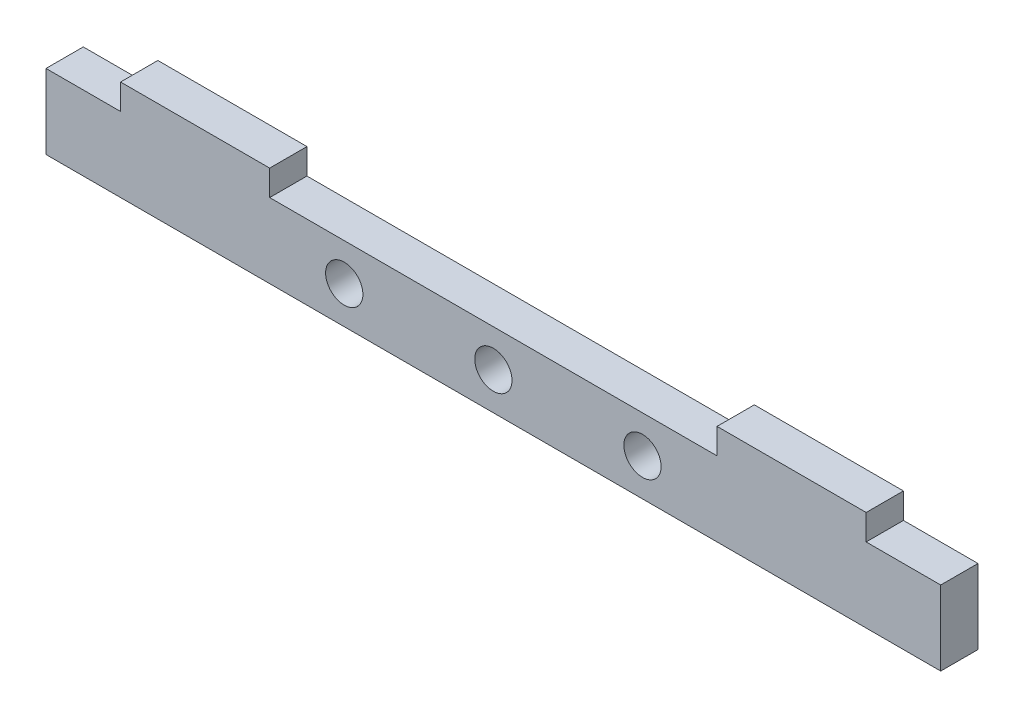
ISO-10303-21;
HEADER;
FILE_DESCRIPTION(('STEP AP214'),'2;1');
FILE_NAME('part.step','',(''),(''),'','','');
FILE_SCHEMA(('AUTOMOTIVE_DESIGN { 1 0 10303 214 1 1 1 1 }'));
ENDSEC;
DATA;
#1=APPLICATION_CONTEXT('core data for automotive mechanical design processes');
#2=APPLICATION_PROTOCOL_DEFINITION('international standard','automotive_design',2000,#1);
#3=PRODUCT_CONTEXT('',#1,'mechanical');
#4=PRODUCT('Part','Part','',(#3));
#5=PRODUCT_RELATED_PRODUCT_CATEGORY('part','',(#4));
#6=PRODUCT_DEFINITION_FORMATION('','',#4);
#7=PRODUCT_DEFINITION_CONTEXT('part definition',#1,'design');
#8=PRODUCT_DEFINITION('design','',#6,#7);
#9=PRODUCT_DEFINITION_SHAPE('','',#8);
#10=(LENGTH_UNIT() NAMED_UNIT(*) SI_UNIT(.MILLI.,.METRE.));
#11=(NAMED_UNIT(*) PLANE_ANGLE_UNIT() SI_UNIT($,.RADIAN.));
#12=(NAMED_UNIT(*) SI_UNIT($,.STERADIAN.) SOLID_ANGLE_UNIT());
#13=UNCERTAINTY_MEASURE_WITH_UNIT(LENGTH_MEASURE(1.E-05),#10,'distance_accuracy_value','');
#14=(GEOMETRIC_REPRESENTATION_CONTEXT(3) GLOBAL_UNCERTAINTY_ASSIGNED_CONTEXT((#13)) GLOBAL_UNIT_ASSIGNED_CONTEXT((#10,
#11,#12)) REPRESENTATION_CONTEXT('',''));
#15=CARTESIAN_POINT('',(0.,0.,0.));
#16=DIRECTION('',(0.,0.,1.));
#17=DIRECTION('',(1.,0.,0.));
#18=AXIS2_PLACEMENT_3D('',#15,#16,#17);
#19=CARTESIAN_POINT('',(0.,0.,6.35));
#20=DIRECTION('',(0.,0.,-1.));
#21=DIRECTION('',(-1.,0.,0.));
#22=AXIS2_PLACEMENT_3D('',#19,#20,#21);
#23=PLANE('',#22);
#24=CARTESIAN_POINT('',(76.2,6.35,6.35));
#25=DIRECTION('',(0.,0.,1.));
#26=DIRECTION('',(1.,0.,0.));
#27=AXIS2_PLACEMENT_3D('',#24,#25,#26);
#28=CIRCLE('',#27,3.175);
#29=CARTESIAN_POINT('',(79.375,6.35,6.35));
#30=VERTEX_POINT('',#29);
#31=EDGE_CURVE('E287',#30,#30,#28,.T.);
#32=ORIENTED_EDGE('',*,*,#31,.F.);
#33=EDGE_LOOP('',(#32));
#34=FACE_BOUND('',#33,.T.);
#35=DIRECTION('',(0.,-1.,0.));
#36=VECTOR('',#35,1.);
#37=CARTESIAN_POINT('',(0.,0.,6.35));
#38=LINE('',#37,#36);
#39=CARTESIAN_POINT('',(0.,12.7,6.35));
#40=VERTEX_POINT('',#39);
#41=CARTESIAN_POINT('',(0.,0.,6.35));
#42=VERTEX_POINT('',#41);
#43=EDGE_CURVE('E177',#40,#42,#38,.T.);
#44=ORIENTED_EDGE('',*,*,#43,.T.);
#45=DIRECTION('',(1.,0.,0.));
#46=VECTOR('',#45,1.);
#47=CARTESIAN_POINT('',(0.,0.,6.35));
#48=LINE('',#47,#46);
#49=CARTESIAN_POINT('',(152.4,0.,6.35));
#50=VERTEX_POINT('',#49);
#51=EDGE_CURVE('E105',#42,#50,#48,.T.);
#52=ORIENTED_EDGE('',*,*,#51,.T.);
#53=DIRECTION('',(0.,1.,0.));
#54=VECTOR('',#53,1.);
#55=CARTESIAN_POINT('',(152.4,0.,6.35));
#56=LINE('',#55,#54);
#57=CARTESIAN_POINT('',(152.4,12.7,6.35));
#58=VERTEX_POINT('',#57);
#59=EDGE_CURVE('E204',#50,#58,#56,.T.);
#60=ORIENTED_EDGE('',*,*,#59,.T.);
#61=DIRECTION('',(-1.,0.,0.));
#62=VECTOR('',#61,1.);
#63=CARTESIAN_POINT('',(139.7,12.7000000000001,6.35));
#64=LINE('',#63,#62);
#65=CARTESIAN_POINT('',(139.7,12.7000000000001,6.35));
#66=VERTEX_POINT('',#65);
#67=EDGE_CURVE('E223',#58,#66,#64,.T.);
#68=ORIENTED_EDGE('',*,*,#67,.T.);
#69=DIRECTION('',(0.,1.,0.));
#70=VECTOR('',#69,1.);
#71=CARTESIAN_POINT('',(139.7,12.7000000000001,6.35));
#72=LINE('',#71,#70);
#73=CARTESIAN_POINT('',(139.7,17.0501666846627,6.35));
#74=VERTEX_POINT('',#73);
#75=EDGE_CURVE('E220',#66,#74,#72,.T.);
#76=ORIENTED_EDGE('',*,*,#75,.T.);
#77=DIRECTION('',(-1.,0.,0.));
#78=VECTOR('',#77,1.);
#79=CARTESIAN_POINT('',(139.7,17.0501666846627,6.35));
#80=LINE('',#79,#78);
#81=CARTESIAN_POINT('',(114.3,17.0501666846625,6.35));
#82=VERTEX_POINT('',#81);
#83=EDGE_CURVE('E222',#74,#82,#80,.T.);
#84=ORIENTED_EDGE('',*,*,#83,.T.);
#85=DIRECTION('',(0.,-1.,0.));
#86=VECTOR('',#85,1.);
#87=CARTESIAN_POINT('',(114.3,12.7,6.35));
#88=LINE('',#87,#86);
#89=CARTESIAN_POINT('',(114.3,12.7,6.35));
#90=VERTEX_POINT('',#89);
#91=EDGE_CURVE('E225',#82,#90,#88,.T.);
#92=ORIENTED_EDGE('',*,*,#91,.T.);
#93=DIRECTION('',(-1.,0.,0.));
#94=VECTOR('',#93,1.);
#95=CARTESIAN_POINT('',(38.1,12.7,6.35));
#96=LINE('',#95,#94);
#97=CARTESIAN_POINT('',(38.1,12.7,6.35));
#98=VERTEX_POINT('',#97);
#99=EDGE_CURVE('E231',#90,#98,#96,.T.);
#100=ORIENTED_EDGE('',*,*,#99,.T.);
#101=DIRECTION('',(0.,1.,0.));
#102=VECTOR('',#101,1.);
#103=CARTESIAN_POINT('',(38.1,12.7,6.35));
#104=LINE('',#103,#102);
#105=CARTESIAN_POINT('',(38.1,17.0501666846626,6.35));
#106=VERTEX_POINT('',#105);
#107=EDGE_CURVE('E136',#98,#106,#104,.T.);
#108=ORIENTED_EDGE('',*,*,#107,.T.);
#109=DIRECTION('',(-1.,0.,0.));
#110=VECTOR('',#109,1.);
#111=CARTESIAN_POINT('',(12.7,17.0501666846626,6.35));
#112=LINE('',#111,#110);
#113=CARTESIAN_POINT('',(12.7,17.0501666846626,6.35));
#114=VERTEX_POINT('',#113);
#115=EDGE_CURVE('E130',#106,#114,#112,.T.);
#116=ORIENTED_EDGE('',*,*,#115,.T.);
#117=DIRECTION('',(0.,-1.,0.));
#118=VECTOR('',#117,1.);
#119=CARTESIAN_POINT('',(12.7,12.7,6.35));
#120=LINE('',#119,#118);
#121=CARTESIAN_POINT('',(12.7,12.7,6.35));
#122=VERTEX_POINT('',#121);
#123=EDGE_CURVE('E134',#114,#122,#120,.T.);
#124=ORIENTED_EDGE('',*,*,#123,.T.);
#125=DIRECTION('',(-1.,0.,0.));
#126=VECTOR('',#125,1.);
#127=CARTESIAN_POINT('',(0.,12.7,6.35));
#128=LINE('',#127,#126);
#129=EDGE_CURVE('E50',#122,#40,#128,.T.);
#130=ORIENTED_EDGE('',*,*,#129,.T.);
#131=EDGE_LOOP('',(#44,#52,#60,#68,#76,#84,#92,#100,#108,#116,#124,#130));
#132=FACE_BOUND('',#131,.T.);
#133=CARTESIAN_POINT('',(50.8,6.35,6.35));
#134=DIRECTION('',(0.,0.,1.));
#135=DIRECTION('',(1.,0.,0.));
#136=AXIS2_PLACEMENT_3D('',#133,#134,#135);
#137=CIRCLE('',#136,3.175);
#138=CARTESIAN_POINT('',(53.975,6.35,6.35));
#139=VERTEX_POINT('',#138);
#140=EDGE_CURVE('E158',#139,#139,#137,.T.);
#141=ORIENTED_EDGE('',*,*,#140,.F.);
#142=EDGE_LOOP('',(#141));
#143=FACE_BOUND('',#142,.T.);
#144=CARTESIAN_POINT('',(101.6,6.35,6.35));
#145=DIRECTION('',(0.,0.,1.));
#146=DIRECTION('',(1.,0.,0.));
#147=AXIS2_PLACEMENT_3D('',#144,#145,#146);
#148=CIRCLE('',#147,3.175);
#149=CARTESIAN_POINT('',(104.775,6.35,6.35));
#150=VERTEX_POINT('',#149);
#151=EDGE_CURVE('E278',#150,#150,#148,.T.);
#152=ORIENTED_EDGE('',*,*,#151,.F.);
#153=EDGE_LOOP('',(#152));
#154=FACE_BOUND('',#153,.T.);
#155=ADVANCED_FACE('F33',(#34,#132,#143,#154),#23,.F.);
#156=CARTESIAN_POINT('',(0.,0.,0.));
#157=DIRECTION('',(0.,0.,-1.));
#158=DIRECTION('',(-1.,0.,0.));
#159=AXIS2_PLACEMENT_3D('',#156,#157,#158);
#160=PLANE('',#159);
#161=CARTESIAN_POINT('',(76.2,6.35,0.));
#162=DIRECTION('',(0.,0.,1.));
#163=DIRECTION('',(1.,0.,0.));
#164=AXIS2_PLACEMENT_3D('',#161,#162,#163);
#165=CIRCLE('',#164,3.175);
#166=CARTESIAN_POINT('',(79.375,6.35,0.));
#167=VERTEX_POINT('',#166);
#168=EDGE_CURVE('E284',#167,#167,#165,.T.);
#169=ORIENTED_EDGE('',*,*,#168,.T.);
#170=EDGE_LOOP('',(#169));
#171=FACE_BOUND('',#170,.T.);
#172=DIRECTION('',(0.,-1.,0.));
#173=VECTOR('',#172,1.);
#174=CARTESIAN_POINT('',(0.,0.,0.));
#175=LINE('',#174,#173);
#176=CARTESIAN_POINT('',(0.,12.7,0.));
#177=VERTEX_POINT('',#176);
#178=CARTESIAN_POINT('',(0.,0.,0.));
#179=VERTEX_POINT('',#178);
#180=EDGE_CURVE('E154',#177,#179,#175,.T.);
#181=ORIENTED_EDGE('',*,*,#180,.F.);
#182=DIRECTION('',(-1.,0.,0.));
#183=VECTOR('',#182,1.);
#184=CARTESIAN_POINT('',(0.,12.7,0.));
#185=LINE('',#184,#183);
#186=CARTESIAN_POINT('',(12.7,12.7,0.));
#187=VERTEX_POINT('',#186);
#188=EDGE_CURVE('E97',#187,#177,#185,.T.);
#189=ORIENTED_EDGE('',*,*,#188,.F.);
#190=DIRECTION('',(0.,-1.,0.));
#191=VECTOR('',#190,1.);
#192=CARTESIAN_POINT('',(12.7,12.7,0.));
#193=LINE('',#192,#191);
#194=CARTESIAN_POINT('',(12.7,17.0501666846626,0.));
#195=VERTEX_POINT('',#194);
#196=EDGE_CURVE('E91',#195,#187,#193,.T.);
#197=ORIENTED_EDGE('',*,*,#196,.F.);
#198=DIRECTION('',(-1.,0.,0.));
#199=VECTOR('',#198,1.);
#200=CARTESIAN_POINT('',(12.7,17.0501666846626,0.));
#201=LINE('',#200,#199);
#202=CARTESIAN_POINT('',(38.1,17.0501666846626,0.));
#203=VERTEX_POINT('',#202);
#204=EDGE_CURVE('E144',#203,#195,#201,.T.);
#205=ORIENTED_EDGE('',*,*,#204,.F.);
#206=DIRECTION('',(0.,1.,0.));
#207=VECTOR('',#206,1.);
#208=CARTESIAN_POINT('',(38.1,12.7,0.));
#209=LINE('',#208,#207);
#210=CARTESIAN_POINT('',(38.1,12.7,0.));
#211=VERTEX_POINT('',#210);
#212=EDGE_CURVE('E172',#211,#203,#209,.T.);
#213=ORIENTED_EDGE('',*,*,#212,.F.);
#214=DIRECTION('',(-1.,0.,0.));
#215=VECTOR('',#214,1.);
#216=CARTESIAN_POINT('',(38.1,12.7,0.));
#217=LINE('',#216,#215);
#218=CARTESIAN_POINT('',(114.3,12.7,0.));
#219=VERTEX_POINT('',#218);
#220=EDGE_CURVE('E170',#219,#211,#217,.T.);
#221=ORIENTED_EDGE('',*,*,#220,.F.);
#222=DIRECTION('',(0.,-1.,0.));
#223=VECTOR('',#222,1.);
#224=CARTESIAN_POINT('',(114.3,12.7,0.));
#225=LINE('',#224,#223);
#226=CARTESIAN_POINT('',(114.3,17.0501666846625,0.));
#227=VERTEX_POINT('',#226);
#228=EDGE_CURVE('E168',#227,#219,#225,.T.);
#229=ORIENTED_EDGE('',*,*,#228,.F.);
#230=DIRECTION('',(-1.,0.,0.));
#231=VECTOR('',#230,1.);
#232=CARTESIAN_POINT('',(139.7,17.0501666846627,0.));
#233=LINE('',#232,#231);
#234=CARTESIAN_POINT('',(139.7,17.0501666846627,0.));
#235=VERTEX_POINT('',#234);
#236=EDGE_CURVE('E166',#235,#227,#233,.T.);
#237=ORIENTED_EDGE('',*,*,#236,.F.);
#238=DIRECTION('',(0.,1.,0.));
#239=VECTOR('',#238,1.);
#240=CARTESIAN_POINT('',(139.7,12.7000000000001,0.));
#241=LINE('',#240,#239);
#242=CARTESIAN_POINT('',(139.7,12.7000000000001,0.));
#243=VERTEX_POINT('',#242);
#244=EDGE_CURVE('E164',#243,#235,#241,.T.);
#245=ORIENTED_EDGE('',*,*,#244,.F.);
#246=DIRECTION('',(-1.,0.,0.));
#247=VECTOR('',#246,1.);
#248=CARTESIAN_POINT('',(139.7,12.7000000000001,0.));
#249=LINE('',#248,#247);
#250=CARTESIAN_POINT('',(152.4,12.7,0.));
#251=VERTEX_POINT('',#250);
#252=EDGE_CURVE('E162',#251,#243,#249,.T.);
#253=ORIENTED_EDGE('',*,*,#252,.F.);
#254=DIRECTION('',(0.,1.,0.));
#255=VECTOR('',#254,1.);
#256=CARTESIAN_POINT('',(152.4,0.,0.));
#257=LINE('',#256,#255);
#258=CARTESIAN_POINT('',(152.4,0.,0.));
#259=VERTEX_POINT('',#258);
#260=EDGE_CURVE('E160',#259,#251,#257,.T.);
#261=ORIENTED_EDGE('',*,*,#260,.F.);
#262=DIRECTION('',(1.,0.,0.));
#263=VECTOR('',#262,1.);
#264=CARTESIAN_POINT('',(0.,0.,0.));
#265=LINE('',#264,#263);
#266=EDGE_CURVE('E157',#179,#259,#265,.T.);
#267=ORIENTED_EDGE('',*,*,#266,.F.);
#268=EDGE_LOOP('',(#181,#189,#197,#205,#213,#221,#229,#237,#245,#253,#261,#267));
#269=FACE_BOUND('',#268,.T.);
#270=CARTESIAN_POINT('',(50.8,6.35,0.));
#271=DIRECTION('',(0.,0.,1.));
#272=DIRECTION('',(1.,0.,0.));
#273=AXIS2_PLACEMENT_3D('',#270,#271,#272);
#274=CIRCLE('',#273,3.175);
#275=CARTESIAN_POINT('',(53.975,6.35,0.));
#276=VERTEX_POINT('',#275);
#277=EDGE_CURVE('E290',#276,#276,#274,.T.);
#278=ORIENTED_EDGE('',*,*,#277,.T.);
#279=EDGE_LOOP('',(#278));
#280=FACE_BOUND('',#279,.T.);
#281=CARTESIAN_POINT('',(101.6,6.35,0.));
#282=DIRECTION('',(0.,0.,1.));
#283=DIRECTION('',(1.,0.,0.));
#284=AXIS2_PLACEMENT_3D('',#281,#282,#283);
#285=CIRCLE('',#284,3.175);
#286=CARTESIAN_POINT('',(104.775,6.35,0.));
#287=VERTEX_POINT('',#286);
#288=EDGE_CURVE('E281',#287,#287,#285,.T.);
#289=ORIENTED_EDGE('',*,*,#288,.T.);
#290=EDGE_LOOP('',(#289));
#291=FACE_BOUND('',#290,.T.);
#292=ADVANCED_FACE('F208',(#171,#269,#280,#291),#160,.T.);
#293=CARTESIAN_POINT('',(0.,0.,6.35));
#294=DIRECTION('',(1.,0.,0.));
#295=DIRECTION('',(0.,0.,-1.));
#296=AXIS2_PLACEMENT_3D('',#293,#294,#295);
#297=PLANE('',#296);
#298=ORIENTED_EDGE('',*,*,#180,.T.);
#299=DIRECTION('',(0.,0.,-1.));
#300=VECTOR('',#299,1.);
#301=CARTESIAN_POINT('',(0.,0.,6.35));
#302=LINE('',#301,#300);
#303=EDGE_CURVE('E11',#42,#179,#302,.T.);
#304=ORIENTED_EDGE('',*,*,#303,.F.);
#305=ORIENTED_EDGE('',*,*,#43,.F.);
#306=DIRECTION('',(0.,0.,-1.));
#307=VECTOR('',#306,1.);
#308=CARTESIAN_POINT('',(0.,12.7,6.35));
#309=LINE('',#308,#307);
#310=EDGE_CURVE('E150',#40,#177,#309,.T.);
#311=ORIENTED_EDGE('',*,*,#310,.T.);
#312=EDGE_LOOP('',(#298,#304,#305,#311));
#313=FACE_BOUND('',#312,.T.);
#314=ADVANCED_FACE('F35',(#313),#297,.F.);
#315=CARTESIAN_POINT('',(0.,0.,6.35));
#316=DIRECTION('',(0.,1.,0.));
#317=DIRECTION('',(-1.,0.,0.));
#318=AXIS2_PLACEMENT_3D('',#315,#316,#317);
#319=PLANE('',#318);
#320=ORIENTED_EDGE('',*,*,#266,.T.);
#321=DIRECTION('',(0.,0.,-1.));
#322=VECTOR('',#321,1.);
#323=CARTESIAN_POINT('',(152.4,0.,6.35));
#324=LINE('',#323,#322);
#325=EDGE_CURVE('E42',#50,#259,#324,.T.);
#326=ORIENTED_EDGE('',*,*,#325,.F.);
#327=ORIENTED_EDGE('',*,*,#51,.F.);
#328=ORIENTED_EDGE('',*,*,#303,.T.);
#329=EDGE_LOOP('',(#320,#326,#327,#328));
#330=FACE_BOUND('',#329,.T.);
#331=ADVANCED_FACE('F391',(#330),#319,.F.);
#332=CARTESIAN_POINT('',(152.4,0.,6.35));
#333=DIRECTION('',(-1.,0.,0.));
#334=DIRECTION('',(0.,0.,1.));
#335=AXIS2_PLACEMENT_3D('',#332,#333,#334);
#336=PLANE('',#335);
#337=ORIENTED_EDGE('',*,*,#260,.T.);
#338=DIRECTION('',(0.,0.,-1.));
#339=VECTOR('',#338,1.);
#340=CARTESIAN_POINT('',(152.4,12.7,6.35));
#341=LINE('',#340,#339);
#342=EDGE_CURVE('E196',#58,#251,#341,.T.);
#343=ORIENTED_EDGE('',*,*,#342,.F.);
#344=ORIENTED_EDGE('',*,*,#59,.F.);
#345=ORIENTED_EDGE('',*,*,#325,.T.);
#346=EDGE_LOOP('',(#337,#343,#344,#345));
#347=FACE_BOUND('',#346,.T.);
#348=ADVANCED_FACE('F202',(#347),#336,.F.);
#349=CARTESIAN_POINT('',(139.7,12.7000000000001,6.35));
#350=DIRECTION('',(0.,-1.,0.));
#351=DIRECTION('',(1.,0.,0.));
#352=AXIS2_PLACEMENT_3D('',#349,#350,#351);
#353=PLANE('',#352);
#354=ORIENTED_EDGE('',*,*,#252,.T.);
#355=DIRECTION('',(0.,0.,-1.));
#356=VECTOR('',#355,1.);
#357=CARTESIAN_POINT('',(139.7,12.7000000000001,6.35));
#358=LINE('',#357,#356);
#359=EDGE_CURVE('E193',#66,#243,#358,.T.);
#360=ORIENTED_EDGE('',*,*,#359,.F.);
#361=ORIENTED_EDGE('',*,*,#67,.F.);
#362=ORIENTED_EDGE('',*,*,#342,.T.);
#363=EDGE_LOOP('',(#354,#360,#361,#362));
#364=FACE_BOUND('',#363,.T.);
#365=ADVANCED_FACE('F214',(#364),#353,.F.);
#366=CARTESIAN_POINT('',(139.7,12.7000000000001,6.35));
#367=DIRECTION('',(-1.,0.,0.));
#368=DIRECTION('',(0.,0.,1.));
#369=AXIS2_PLACEMENT_3D('',#366,#367,#368);
#370=PLANE('',#369);
#371=ORIENTED_EDGE('',*,*,#244,.T.);
#372=DIRECTION('',(0.,0.,-1.));
#373=VECTOR('',#372,1.);
#374=CARTESIAN_POINT('',(139.7,17.0501666846627,6.35));
#375=LINE('',#374,#373);
#376=EDGE_CURVE('E190',#74,#235,#375,.T.);
#377=ORIENTED_EDGE('',*,*,#376,.F.);
#378=ORIENTED_EDGE('',*,*,#75,.F.);
#379=ORIENTED_EDGE('',*,*,#359,.T.);
#380=EDGE_LOOP('',(#371,#377,#378,#379));
#381=FACE_BOUND('',#380,.T.);
#382=ADVANCED_FACE('F218',(#381),#370,.F.);
#383=CARTESIAN_POINT('',(139.7,17.0501666846627,6.35));
#384=DIRECTION('',(0.,-1.,0.));
#385=DIRECTION('',(1.,0.,0.));
#386=AXIS2_PLACEMENT_3D('',#383,#384,#385);
#387=PLANE('',#386);
#388=ORIENTED_EDGE('',*,*,#236,.T.);
#389=DIRECTION('',(0.,0.,-1.));
#390=VECTOR('',#389,1.);
#391=CARTESIAN_POINT('',(114.3,17.0501666846625,6.35));
#392=LINE('',#391,#390);
#393=EDGE_CURVE('E187',#82,#227,#392,.T.);
#394=ORIENTED_EDGE('',*,*,#393,.F.);
#395=ORIENTED_EDGE('',*,*,#83,.F.);
#396=ORIENTED_EDGE('',*,*,#376,.T.);
#397=EDGE_LOOP('',(#388,#394,#395,#396));
#398=FACE_BOUND('',#397,.T.);
#399=ADVANCED_FACE('F356',(#398),#387,.F.);
#400=CARTESIAN_POINT('',(114.3,12.7,6.35));
#401=DIRECTION('',(1.,0.,0.));
#402=DIRECTION('',(0.,0.,-1.));
#403=AXIS2_PLACEMENT_3D('',#400,#401,#402);
#404=PLANE('',#403);
#405=ORIENTED_EDGE('',*,*,#228,.T.);
#406=DIRECTION('',(0.,0.,-1.));
#407=VECTOR('',#406,1.);
#408=CARTESIAN_POINT('',(114.3,12.7,6.35));
#409=LINE('',#408,#407);
#410=EDGE_CURVE('E184',#90,#219,#409,.T.);
#411=ORIENTED_EDGE('',*,*,#410,.F.);
#412=ORIENTED_EDGE('',*,*,#91,.F.);
#413=ORIENTED_EDGE('',*,*,#393,.T.);
#414=EDGE_LOOP('',(#405,#411,#412,#413));
#415=FACE_BOUND('',#414,.T.);
#416=ADVANCED_FACE('F347',(#415),#404,.F.);
#417=CARTESIAN_POINT('',(38.1,12.7,6.35));
#418=DIRECTION('',(0.,-1.,0.));
#419=DIRECTION('',(1.,0.,0.));
#420=AXIS2_PLACEMENT_3D('',#417,#418,#419);
#421=PLANE('',#420);
#422=ORIENTED_EDGE('',*,*,#220,.T.);
#423=DIRECTION('',(0.,0.,-1.));
#424=VECTOR('',#423,1.);
#425=CARTESIAN_POINT('',(38.1,12.7,6.35));
#426=LINE('',#425,#424);
#427=EDGE_CURVE('E181',#98,#211,#426,.T.);
#428=ORIENTED_EDGE('',*,*,#427,.F.);
#429=ORIENTED_EDGE('',*,*,#99,.F.);
#430=ORIENTED_EDGE('',*,*,#410,.T.);
#431=EDGE_LOOP('',(#422,#428,#429,#430));
#432=FACE_BOUND('',#431,.T.);
#433=ADVANCED_FACE('F237',(#432),#421,.F.);
#434=CARTESIAN_POINT('',(38.1,12.7,6.35));
#435=DIRECTION('',(-1.,0.,0.));
#436=DIRECTION('',(0.,0.,1.));
#437=AXIS2_PLACEMENT_3D('',#434,#435,#436);
#438=PLANE('',#437);
#439=ORIENTED_EDGE('',*,*,#212,.T.);
#440=DIRECTION('',(0.,0.,-1.));
#441=VECTOR('',#440,1.);
#442=CARTESIAN_POINT('',(38.1,17.0501666846626,6.35));
#443=LINE('',#442,#441);
#444=EDGE_CURVE('E145',#106,#203,#443,.T.);
#445=ORIENTED_EDGE('',*,*,#444,.F.);
#446=ORIENTED_EDGE('',*,*,#107,.F.);
#447=ORIENTED_EDGE('',*,*,#427,.T.);
#448=EDGE_LOOP('',(#439,#445,#446,#447));
#449=FACE_BOUND('',#448,.T.);
#450=ADVANCED_FACE('F241',(#449),#438,.F.);
#451=CARTESIAN_POINT('',(12.7,17.0501666846626,6.35));
#452=DIRECTION('',(0.,-1.,0.));
#453=DIRECTION('',(0.,0.,-1.));
#454=AXIS2_PLACEMENT_3D('',#451,#452,#453);
#455=PLANE('',#454);
#456=ORIENTED_EDGE('',*,*,#204,.T.);
#457=DIRECTION('',(0.,0.,-1.));
#458=VECTOR('',#457,1.);
#459=CARTESIAN_POINT('',(12.7,17.0501666846626,6.35));
#460=LINE('',#459,#458);
#461=EDGE_CURVE('E141',#114,#195,#460,.T.);
#462=ORIENTED_EDGE('',*,*,#461,.F.);
#463=ORIENTED_EDGE('',*,*,#115,.F.);
#464=ORIENTED_EDGE('',*,*,#444,.T.);
#465=EDGE_LOOP('',(#456,#462,#463,#464));
#466=FACE_BOUND('',#465,.T.);
#467=ADVANCED_FACE('F142',(#466),#455,.F.);
#468=CARTESIAN_POINT('',(12.7,12.7,6.35));
#469=DIRECTION('',(1.,0.,0.));
#470=DIRECTION('',(0.,0.,-1.));
#471=AXIS2_PLACEMENT_3D('',#468,#469,#470);
#472=PLANE('',#471);
#473=ORIENTED_EDGE('',*,*,#196,.T.);
#474=DIRECTION('',(0.,0.,-1.));
#475=VECTOR('',#474,1.);
#476=CARTESIAN_POINT('',(12.7,12.7,6.35));
#477=LINE('',#476,#475);
#478=EDGE_CURVE('E146',#122,#187,#477,.T.);
#479=ORIENTED_EDGE('',*,*,#478,.F.);
#480=ORIENTED_EDGE('',*,*,#123,.F.);
#481=ORIENTED_EDGE('',*,*,#461,.T.);
#482=EDGE_LOOP('',(#473,#479,#480,#481));
#483=FACE_BOUND('',#482,.T.);
#484=ADVANCED_FACE('F148',(#483),#472,.F.);
#485=CARTESIAN_POINT('',(0.,12.7,6.35));
#486=DIRECTION('',(0.,-1.,0.));
#487=DIRECTION('',(0.,0.,-1.));
#488=AXIS2_PLACEMENT_3D('',#485,#486,#487);
#489=PLANE('',#488);
#490=ORIENTED_EDGE('',*,*,#188,.T.);
#491=ORIENTED_EDGE('',*,*,#310,.F.);
#492=ORIENTED_EDGE('',*,*,#129,.F.);
#493=ORIENTED_EDGE('',*,*,#478,.T.);
#494=EDGE_LOOP('',(#490,#491,#492,#493));
#495=FACE_BOUND('',#494,.T.);
#496=ADVANCED_FACE('F245',(#495),#489,.F.);
#497=CARTESIAN_POINT('',(50.8,6.35,6.35));
#498=DIRECTION('',(0.,0.,-1.));
#499=DIRECTION('',(-1.,0.,0.));
#500=AXIS2_PLACEMENT_3D('',#497,#498,#499);
#501=CYLINDRICAL_SURFACE('',#500,3.175);
#502=ORIENTED_EDGE('',*,*,#140,.T.);
#503=EDGE_LOOP('',(#502));
#504=FACE_BOUND('',#503,.T.);
#505=ORIENTED_EDGE('',*,*,#277,.F.);
#506=EDGE_LOOP('',(#505));
#507=FACE_BOUND('',#506,.T.);
#508=ADVANCED_FACE('F247',(#504,#507),#501,.F.);
#509=CARTESIAN_POINT('',(76.2,6.35,6.35));
#510=DIRECTION('',(0.,0.,-1.));
#511=DIRECTION('',(-1.,0.,0.));
#512=AXIS2_PLACEMENT_3D('',#509,#510,#511);
#513=CYLINDRICAL_SURFACE('',#512,3.175);
#514=ORIENTED_EDGE('',*,*,#31,.T.);
#515=EDGE_LOOP('',(#514));
#516=FACE_BOUND('',#515,.T.);
#517=ORIENTED_EDGE('',*,*,#168,.F.);
#518=EDGE_LOOP('',(#517));
#519=FACE_BOUND('',#518,.T.);
#520=ADVANCED_FACE('F253',(#516,#519),#513,.F.);
#521=CARTESIAN_POINT('',(101.6,6.35,6.35));
#522=DIRECTION('',(0.,0.,-1.));
#523=DIRECTION('',(-1.,0.,0.));
#524=AXIS2_PLACEMENT_3D('',#521,#522,#523);
#525=CYLINDRICAL_SURFACE('',#524,3.175);
#526=ORIENTED_EDGE('',*,*,#151,.T.);
#527=EDGE_LOOP('',(#526));
#528=FACE_BOUND('',#527,.T.);
#529=ORIENTED_EDGE('',*,*,#288,.F.);
#530=EDGE_LOOP('',(#529));
#531=FACE_BOUND('',#530,.T.);
#532=ADVANCED_FACE('F269',(#528,#531),#525,.F.);
#533=CLOSED_SHELL('',(#155,#292,#314,#331,#348,#365,#382,#399,#416,#433,#450,#467,#484,#496,
#508,#520,#532));
#534=MANIFOLD_SOLID_BREP('B2',#533);
#535=ADVANCED_BREP_SHAPE_REPRESENTATION('',(#18,#534),#14);
#536=SHAPE_DEFINITION_REPRESENTATION(#9,#535);
ENDSEC;
END-ISO-10303-21;
